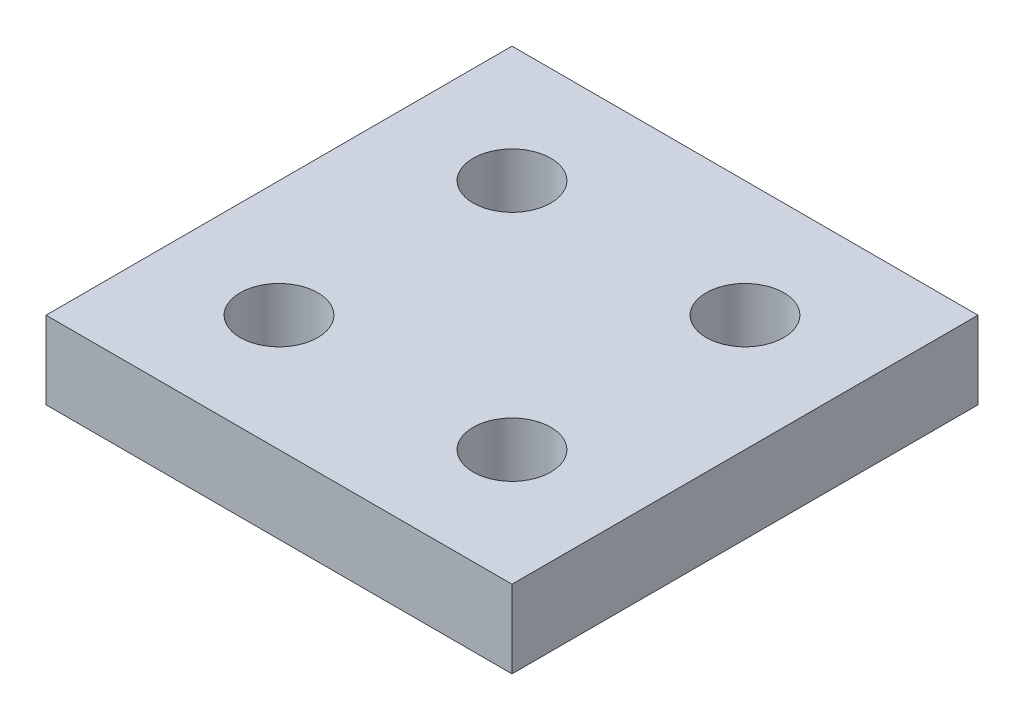
ISO-10303-21;
HEADER;
FILE_DESCRIPTION(('STEP AP214'),'2;1');
FILE_NAME('part.step','',(''),(''),'','','');
FILE_SCHEMA(('AUTOMOTIVE_DESIGN { 1 0 10303 214 1 1 1 1 }'));
ENDSEC;
DATA;
#1=APPLICATION_CONTEXT('core data for automotive mechanical design processes');
#2=APPLICATION_PROTOCOL_DEFINITION('international standard','automotive_design',2000,#1);
#3=PRODUCT_CONTEXT('',#1,'mechanical');
#4=PRODUCT('Part','Part','',(#3));
#5=PRODUCT_RELATED_PRODUCT_CATEGORY('part','',(#4));
#6=PRODUCT_DEFINITION_FORMATION('','',#4);
#7=PRODUCT_DEFINITION_CONTEXT('part definition',#1,'design');
#8=PRODUCT_DEFINITION('design','',#6,#7);
#9=PRODUCT_DEFINITION_SHAPE('','',#8);
#10=(LENGTH_UNIT() NAMED_UNIT(*) SI_UNIT(.MILLI.,.METRE.));
#11=(NAMED_UNIT(*) PLANE_ANGLE_UNIT() SI_UNIT($,.RADIAN.));
#12=(NAMED_UNIT(*) SI_UNIT($,.STERADIAN.) SOLID_ANGLE_UNIT());
#13=UNCERTAINTY_MEASURE_WITH_UNIT(LENGTH_MEASURE(1.E-05),#10,'distance_accuracy_value','');
#14=(GEOMETRIC_REPRESENTATION_CONTEXT(3) GLOBAL_UNCERTAINTY_ASSIGNED_CONTEXT((#13)) GLOBAL_UNIT_ASSIGNED_CONTEXT((#10,
#11,#12)) REPRESENTATION_CONTEXT('',''));
#15=CARTESIAN_POINT('',(0.,0.,0.));
#16=DIRECTION('',(0.,0.,1.));
#17=DIRECTION('',(1.,0.,0.));
#18=AXIS2_PLACEMENT_3D('',#15,#16,#17);
#19=CARTESIAN_POINT('',(0.,9.99999999999999,0.));
#20=DIRECTION('',(0.,1.,0.));
#21=DIRECTION('',(0.,0.,1.));
#22=AXIS2_PLACEMENT_3D('',#19,#20,#21);
#23=PLANE('',#22);
#24=CARTESIAN_POINT('',(45.0000000000003,9.99999999999999,-15.));
#25=DIRECTION('',(0.,1.,0.));
#26=DIRECTION('',(0.,0.,1.));
#27=AXIS2_PLACEMENT_3D('',#24,#25,#26);
#28=CIRCLE('',#27,5.);
#29=CARTESIAN_POINT('',(45.0000000000003,9.99999999999999,-9.99999999999999));
#30=VERTEX_POINT('',#29);
#31=EDGE_CURVE('E139',#30,#30,#28,.T.);
#32=ORIENTED_EDGE('',*,*,#31,.F.);
#33=EDGE_LOOP('',(#32));
#34=FACE_BOUND('',#33,.T.);
#35=CARTESIAN_POINT('',(15.,9.99999999999999,-45.));
#36=DIRECTION('',(0.,1.,0.));
#37=DIRECTION('',(0.,0.,1.));
#38=AXIS2_PLACEMENT_3D('',#35,#36,#37);
#39=CIRCLE('',#38,5.);
#40=CARTESIAN_POINT('',(15.,9.99999999999999,-40.));
#41=VERTEX_POINT('',#40);
#42=EDGE_CURVE('E109',#41,#41,#39,.T.);
#43=ORIENTED_EDGE('',*,*,#42,.F.);
#44=EDGE_LOOP('',(#43));
#45=FACE_BOUND('',#44,.T.);
#46=DIRECTION('',(0.,0.,1.));
#47=VECTOR('',#46,1.);
#48=CARTESIAN_POINT('',(0.,9.99999999999999,-60.));
#49=LINE('',#48,#47);
#50=CARTESIAN_POINT('',(0.,9.99999999999999,-60.));
#51=VERTEX_POINT('',#50);
#52=CARTESIAN_POINT('',(0.,9.99999999999999,0.));
#53=VERTEX_POINT('',#52);
#54=EDGE_CURVE('E89',#51,#53,#49,.T.);
#55=ORIENTED_EDGE('',*,*,#54,.T.);
#56=DIRECTION('',(1.,0.,0.));
#57=VECTOR('',#56,1.);
#58=CARTESIAN_POINT('',(0.,9.99999999999999,0.));
#59=LINE('',#58,#57);
#60=CARTESIAN_POINT('',(60.,9.99999999999999,0.));
#61=VERTEX_POINT('',#60);
#62=EDGE_CURVE('E84',#53,#61,#59,.T.);
#63=ORIENTED_EDGE('',*,*,#62,.T.);
#64=DIRECTION('',(0.,0.,-1.));
#65=VECTOR('',#64,1.);
#66=CARTESIAN_POINT('',(60.,9.99999999999999,0.));
#67=LINE('',#66,#65);
#68=CARTESIAN_POINT('',(60.,9.99999999999999,-60.));
#69=VERTEX_POINT('',#68);
#70=EDGE_CURVE('E87',#61,#69,#67,.T.);
#71=ORIENTED_EDGE('',*,*,#70,.T.);
#72=DIRECTION('',(-1.,0.,0.));
#73=VECTOR('',#72,1.);
#74=CARTESIAN_POINT('',(60.,9.99999999999999,-60.));
#75=LINE('',#74,#73);
#76=EDGE_CURVE('E54',#69,#51,#75,.T.);
#77=ORIENTED_EDGE('',*,*,#76,.T.);
#78=EDGE_LOOP('',(#55,#63,#71,#77));
#79=FACE_BOUND('',#78,.T.);
#80=CARTESIAN_POINT('',(45.,9.99999999999999,-45.));
#81=DIRECTION('',(0.,1.,0.));
#82=DIRECTION('',(0.,0.,1.));
#83=AXIS2_PLACEMENT_3D('',#80,#81,#82);
#84=CIRCLE('',#83,5.);
#85=CARTESIAN_POINT('',(45.,9.99999999999999,-40.));
#86=VERTEX_POINT('',#85);
#87=EDGE_CURVE('E131',#86,#86,#84,.T.);
#88=ORIENTED_EDGE('',*,*,#87,.F.);
#89=EDGE_LOOP('',(#88));
#90=FACE_BOUND('',#89,.T.);
#91=CARTESIAN_POINT('',(15.0000000000003,9.99999999999999,-15.));
#92=DIRECTION('',(0.,1.,0.));
#93=DIRECTION('',(0.,0.,1.));
#94=AXIS2_PLACEMENT_3D('',#91,#92,#93);
#95=CIRCLE('',#94,5.);
#96=CARTESIAN_POINT('',(15.0000000000003,9.99999999999999,-9.99999999999999));
#97=VERTEX_POINT('',#96);
#98=EDGE_CURVE('E147',#97,#97,#95,.T.);
#99=ORIENTED_EDGE('',*,*,#98,.F.);
#100=EDGE_LOOP('',(#99));
#101=FACE_BOUND('',#100,.T.);
#102=ADVANCED_FACE('F36',(#34,#45,#79,#90,#101),#23,.T.);
#103=CARTESIAN_POINT('',(0.,0.,0.));
#104=DIRECTION('',(0.,1.,0.));
#105=DIRECTION('',(0.,0.,1.));
#106=AXIS2_PLACEMENT_3D('',#103,#104,#105);
#107=PLANE('',#106);
#108=DIRECTION('',(0.,0.,1.));
#109=VECTOR('',#108,1.);
#110=CARTESIAN_POINT('',(0.,0.,-60.));
#111=LINE('',#110,#109);
#112=CARTESIAN_POINT('',(0.,0.,-60.));
#113=VERTEX_POINT('',#112);
#114=CARTESIAN_POINT('',(0.,0.,0.));
#115=VERTEX_POINT('',#114);
#116=EDGE_CURVE('E105',#113,#115,#111,.T.);
#117=ORIENTED_EDGE('',*,*,#116,.F.);
#118=DIRECTION('',(-1.,0.,0.));
#119=VECTOR('',#118,1.);
#120=CARTESIAN_POINT('',(60.,0.,-60.));
#121=LINE('',#120,#119);
#122=CARTESIAN_POINT('',(60.,0.,-60.));
#123=VERTEX_POINT('',#122);
#124=EDGE_CURVE('E77',#123,#113,#121,.T.);
#125=ORIENTED_EDGE('',*,*,#124,.F.);
#126=DIRECTION('',(0.,0.,-1.));
#127=VECTOR('',#126,1.);
#128=CARTESIAN_POINT('',(60.,0.,0.));
#129=LINE('',#128,#127);
#130=CARTESIAN_POINT('',(60.,0.,0.));
#131=VERTEX_POINT('',#130);
#132=EDGE_CURVE('E71',#131,#123,#129,.T.);
#133=ORIENTED_EDGE('',*,*,#132,.F.);
#134=DIRECTION('',(1.,0.,0.));
#135=VECTOR('',#134,1.);
#136=CARTESIAN_POINT('',(0.,0.,0.));
#137=LINE('',#136,#135);
#138=EDGE_CURVE('E94',#115,#131,#137,.T.);
#139=ORIENTED_EDGE('',*,*,#138,.F.);
#140=EDGE_LOOP('',(#117,#125,#133,#139));
#141=FACE_BOUND('',#140,.T.);
#142=CARTESIAN_POINT('',(15.,0.,-45.));
#143=DIRECTION('',(0.,1.,0.));
#144=DIRECTION('',(0.,0.,1.));
#145=AXIS2_PLACEMENT_3D('',#142,#143,#144);
#146=CIRCLE('',#145,5.);
#147=CARTESIAN_POINT('',(15.,0.,-40.));
#148=VERTEX_POINT('',#147);
#149=EDGE_CURVE('E127',#148,#148,#146,.T.);
#150=ORIENTED_EDGE('',*,*,#149,.T.);
#151=EDGE_LOOP('',(#150));
#152=FACE_BOUND('',#151,.T.);
#153=CARTESIAN_POINT('',(45.,0.,-45.));
#154=DIRECTION('',(0.,1.,0.));
#155=DIRECTION('',(0.,0.,1.));
#156=AXIS2_PLACEMENT_3D('',#153,#154,#155);
#157=CIRCLE('',#156,5.);
#158=CARTESIAN_POINT('',(45.,0.,-40.));
#159=VERTEX_POINT('',#158);
#160=EDGE_CURVE('E135',#159,#159,#157,.T.);
#161=ORIENTED_EDGE('',*,*,#160,.T.);
#162=EDGE_LOOP('',(#161));
#163=FACE_BOUND('',#162,.T.);
#164=CARTESIAN_POINT('',(45.0000000000003,0.,-15.));
#165=DIRECTION('',(0.,1.,0.));
#166=DIRECTION('',(0.,0.,1.));
#167=AXIS2_PLACEMENT_3D('',#164,#165,#166);
#168=CIRCLE('',#167,5.);
#169=CARTESIAN_POINT('',(45.0000000000003,0.,-9.99999999999999));
#170=VERTEX_POINT('',#169);
#171=EDGE_CURVE('E143',#170,#170,#168,.T.);
#172=ORIENTED_EDGE('',*,*,#171,.T.);
#173=EDGE_LOOP('',(#172));
#174=FACE_BOUND('',#173,.T.);
#175=CARTESIAN_POINT('',(15.0000000000003,0.,-15.));
#176=DIRECTION('',(0.,1.,0.));
#177=DIRECTION('',(0.,0.,1.));
#178=AXIS2_PLACEMENT_3D('',#175,#176,#177);
#179=CIRCLE('',#178,5.);
#180=CARTESIAN_POINT('',(15.0000000000003,0.,-9.99999999999999));
#181=VERTEX_POINT('',#180);
#182=EDGE_CURVE('E151',#181,#181,#179,.T.);
#183=ORIENTED_EDGE('',*,*,#182,.T.);
#184=EDGE_LOOP('',(#183));
#185=FACE_BOUND('',#184,.T.);
#186=ADVANCED_FACE('F122',(#141,#152,#163,#174,#185),#107,.F.);
#187=CARTESIAN_POINT('',(0.,9.99999999999999,-60.));
#188=DIRECTION('',(1.,0.,0.));
#189=DIRECTION('',(0.,0.,-1.));
#190=AXIS2_PLACEMENT_3D('',#187,#188,#189);
#191=PLANE('',#190);
#192=ORIENTED_EDGE('',*,*,#116,.T.);
#193=DIRECTION('',(0.,-1.,0.));
#194=VECTOR('',#193,1.);
#195=CARTESIAN_POINT('',(0.,9.99999999999999,0.));
#196=LINE('',#195,#194);
#197=EDGE_CURVE('E11',#53,#115,#196,.T.);
#198=ORIENTED_EDGE('',*,*,#197,.F.);
#199=ORIENTED_EDGE('',*,*,#54,.F.);
#200=DIRECTION('',(0.,-1.,0.));
#201=VECTOR('',#200,1.);
#202=CARTESIAN_POINT('',(0.,9.99999999999999,-60.));
#203=LINE('',#202,#201);
#204=EDGE_CURVE('E101',#51,#113,#203,.T.);
#205=ORIENTED_EDGE('',*,*,#204,.T.);
#206=EDGE_LOOP('',(#192,#198,#199,#205));
#207=FACE_BOUND('',#206,.T.);
#208=ADVANCED_FACE('F38',(#207),#191,.F.);
#209=CARTESIAN_POINT('',(0.,9.99999999999999,0.));
#210=DIRECTION('',(0.,0.,-1.));
#211=DIRECTION('',(-1.,0.,0.));
#212=AXIS2_PLACEMENT_3D('',#209,#210,#211);
#213=PLANE('',#212);
#214=ORIENTED_EDGE('',*,*,#138,.T.);
#215=DIRECTION('',(0.,-1.,0.));
#216=VECTOR('',#215,1.);
#217=CARTESIAN_POINT('',(60.,9.99999999999999,0.));
#218=LINE('',#217,#216);
#219=EDGE_CURVE('E46',#61,#131,#218,.T.);
#220=ORIENTED_EDGE('',*,*,#219,.F.);
#221=ORIENTED_EDGE('',*,*,#62,.F.);
#222=ORIENTED_EDGE('',*,*,#197,.T.);
#223=EDGE_LOOP('',(#214,#220,#221,#222));
#224=FACE_BOUND('',#223,.T.);
#225=ADVANCED_FACE('F93',(#224),#213,.F.);
#226=CARTESIAN_POINT('',(60.,9.99999999999999,0.));
#227=DIRECTION('',(-1.,0.,0.));
#228=DIRECTION('',(0.,0.,1.));
#229=AXIS2_PLACEMENT_3D('',#226,#227,#228);
#230=PLANE('',#229);
#231=ORIENTED_EDGE('',*,*,#132,.T.);
#232=DIRECTION('',(0.,-1.,0.));
#233=VECTOR('',#232,1.);
#234=CARTESIAN_POINT('',(60.,9.99999999999999,-60.));
#235=LINE('',#234,#233);
#236=EDGE_CURVE('E96',#69,#123,#235,.T.);
#237=ORIENTED_EDGE('',*,*,#236,.F.);
#238=ORIENTED_EDGE('',*,*,#70,.F.);
#239=ORIENTED_EDGE('',*,*,#219,.T.);
#240=EDGE_LOOP('',(#231,#237,#238,#239));
#241=FACE_BOUND('',#240,.T.);
#242=ADVANCED_FACE('F97',(#241),#230,.F.);
#243=CARTESIAN_POINT('',(60.,9.99999999999999,-60.));
#244=DIRECTION('',(0.,0.,1.));
#245=DIRECTION('',(1.,0.,0.));
#246=AXIS2_PLACEMENT_3D('',#243,#244,#245);
#247=PLANE('',#246);
#248=ORIENTED_EDGE('',*,*,#124,.T.);
#249=ORIENTED_EDGE('',*,*,#204,.F.);
#250=ORIENTED_EDGE('',*,*,#76,.F.);
#251=ORIENTED_EDGE('',*,*,#236,.T.);
#252=EDGE_LOOP('',(#248,#249,#250,#251));
#253=FACE_BOUND('',#252,.T.);
#254=ADVANCED_FACE('F119',(#253),#247,.F.);
#255=CARTESIAN_POINT('',(15.,9.99999999999999,-45.));
#256=DIRECTION('',(0.,-1.,0.));
#257=DIRECTION('',(0.,0.,-1.));
#258=AXIS2_PLACEMENT_3D('',#255,#256,#257);
#259=CYLINDRICAL_SURFACE('',#258,5.);
#260=ORIENTED_EDGE('',*,*,#42,.T.);
#261=EDGE_LOOP('',(#260));
#262=FACE_BOUND('',#261,.T.);
#263=ORIENTED_EDGE('',*,*,#149,.F.);
#264=EDGE_LOOP('',(#263));
#265=FACE_BOUND('',#264,.T.);
#266=ADVANCED_FACE('F172',(#262,#265),#259,.F.);
#267=CARTESIAN_POINT('',(45.,9.99999999999999,-45.));
#268=DIRECTION('',(0.,-1.,0.));
#269=DIRECTION('',(0.,0.,-1.));
#270=AXIS2_PLACEMENT_3D('',#267,#268,#269);
#271=CYLINDRICAL_SURFACE('',#270,5.);
#272=ORIENTED_EDGE('',*,*,#87,.T.);
#273=EDGE_LOOP('',(#272));
#274=FACE_BOUND('',#273,.T.);
#275=ORIENTED_EDGE('',*,*,#160,.F.);
#276=EDGE_LOOP('',(#275));
#277=FACE_BOUND('',#276,.T.);
#278=ADVANCED_FACE('F207',(#274,#277),#271,.F.);
#279=CARTESIAN_POINT('',(45.0000000000003,9.99999999999999,-15.));
#280=DIRECTION('',(0.,-1.,0.));
#281=DIRECTION('',(0.,0.,-1.));
#282=AXIS2_PLACEMENT_3D('',#279,#280,#281);
#283=CYLINDRICAL_SURFACE('',#282,5.);
#284=ORIENTED_EDGE('',*,*,#31,.T.);
#285=EDGE_LOOP('',(#284));
#286=FACE_BOUND('',#285,.T.);
#287=ORIENTED_EDGE('',*,*,#171,.F.);
#288=EDGE_LOOP('',(#287));
#289=FACE_BOUND('',#288,.T.);
#290=ADVANCED_FACE('F214',(#286,#289),#283,.F.);
#291=CARTESIAN_POINT('',(15.0000000000003,9.99999999999999,-15.));
#292=DIRECTION('',(0.,-1.,0.));
#293=DIRECTION('',(0.,0.,-1.));
#294=AXIS2_PLACEMENT_3D('',#291,#292,#293);
#295=CYLINDRICAL_SURFACE('',#294,5.);
#296=ORIENTED_EDGE('',*,*,#98,.T.);
#297=EDGE_LOOP('',(#296));
#298=FACE_BOUND('',#297,.T.);
#299=ORIENTED_EDGE('',*,*,#182,.F.);
#300=EDGE_LOOP('',(#299));
#301=FACE_BOUND('',#300,.T.);
#302=ADVANCED_FACE('F159',(#298,#301),#295,.F.);
#303=CLOSED_SHELL('',(#102,#186,#208,#225,#242,#254,#266,#278,#290,#302));
#304=MANIFOLD_SOLID_BREP('B2',#303);
#305=ADVANCED_BREP_SHAPE_REPRESENTATION('',(#18,#304),#14);
#306=SHAPE_DEFINITION_REPRESENTATION(#9,#305);
ENDSEC;
END-ISO-10303-21;
